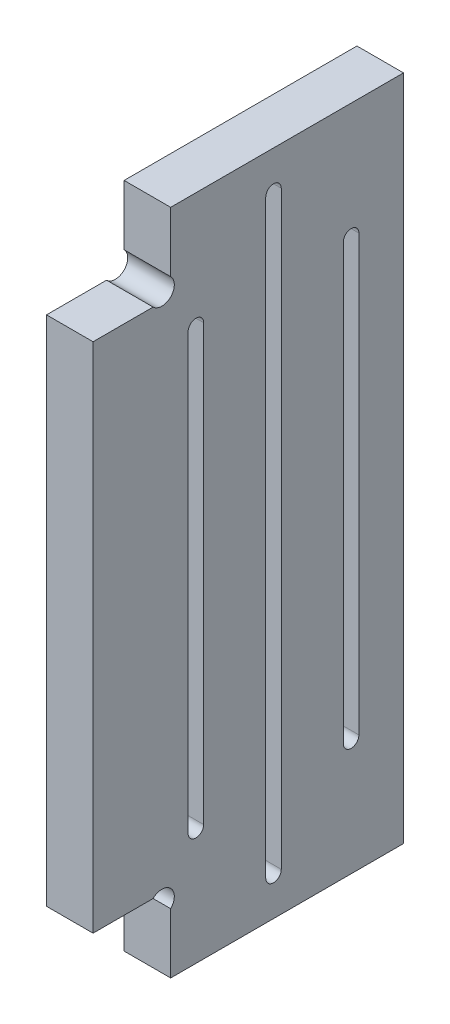
ISO-10303-21;
HEADER;
FILE_DESCRIPTION(('STEP AP214'),'2;1');
FILE_NAME('part.step','',(''),(''),'','','');
FILE_SCHEMA(('AUTOMOTIVE_DESIGN { 1 0 10303 214 1 1 1 1 }'));
ENDSEC;
DATA;
#1=APPLICATION_CONTEXT('core data for automotive mechanical design processes');
#2=APPLICATION_PROTOCOL_DEFINITION('international standard','automotive_design',2000,#1);
#3=PRODUCT_CONTEXT('',#1,'mechanical');
#4=PRODUCT('Part','Part','',(#3));
#5=PRODUCT_RELATED_PRODUCT_CATEGORY('part','',(#4));
#6=PRODUCT_DEFINITION_FORMATION('','',#4);
#7=PRODUCT_DEFINITION_CONTEXT('part definition',#1,'design');
#8=PRODUCT_DEFINITION('design','',#6,#7);
#9=PRODUCT_DEFINITION_SHAPE('','',#8);
#10=(LENGTH_UNIT() NAMED_UNIT(*) SI_UNIT(.MILLI.,.METRE.));
#11=(NAMED_UNIT(*) PLANE_ANGLE_UNIT() SI_UNIT($,.RADIAN.));
#12=(NAMED_UNIT(*) SI_UNIT($,.STERADIAN.) SOLID_ANGLE_UNIT());
#13=UNCERTAINTY_MEASURE_WITH_UNIT(LENGTH_MEASURE(1.E-05),#10,'distance_accuracy_value','');
#14=(GEOMETRIC_REPRESENTATION_CONTEXT(3) GLOBAL_UNCERTAINTY_ASSIGNED_CONTEXT((#13)) GLOBAL_UNIT_ASSIGNED_CONTEXT((#10,
#11,#12)) REPRESENTATION_CONTEXT('',''));
#15=CARTESIAN_POINT('',(0.,0.,0.));
#16=DIRECTION('',(0.,0.,1.));
#17=DIRECTION('',(1.,0.,0.));
#18=AXIS2_PLACEMENT_3D('',#15,#16,#17);
#19=CARTESIAN_POINT('',(6.,219.125569004844,-80.));
#20=DIRECTION('',(0.,0.,-1.));
#21=DIRECTION('',(-1.,0.,0.));
#22=AXIS2_PLACEMENT_3D('',#19,#20,#21);
#23=PLANE('',#22);
#24=DIRECTION('',(0.,-1.,0.));
#25=VECTOR('',#24,1.);
#26=CARTESIAN_POINT('',(0.,219.125569004844,-80.));
#27=LINE('',#26,#25);
#28=CARTESIAN_POINT('',(0.,226.862827305047,-80.));
#29=VERTEX_POINT('',#28);
#30=CARTESIAN_POINT('',(0.,219.125569004844,-80.));
#31=VERTEX_POINT('',#30);
#32=EDGE_CURVE('E219',#29,#31,#27,.T.);
#33=ORIENTED_EDGE('',*,*,#32,.T.);
#34=DIRECTION('',(-1.,0.,0.));
#35=VECTOR('',#34,1.);
#36=CARTESIAN_POINT('',(6.,219.125569004844,-80.));
#37=LINE('',#36,#35);
#38=CARTESIAN_POINT('',(6.,219.125569004844,-80.));
#39=VERTEX_POINT('',#38);
#40=EDGE_CURVE('E11',#39,#31,#37,.T.);
#41=ORIENTED_EDGE('',*,*,#40,.F.);
#42=DIRECTION('',(0.,-1.,0.));
#43=VECTOR('',#42,1.);
#44=CARTESIAN_POINT('',(6.,219.125569004844,-80.));
#45=LINE('',#44,#43);
#46=CARTESIAN_POINT('',(6.,226.862827305047,-80.));
#47=VERTEX_POINT('',#46);
#48=EDGE_CURVE('E284',#47,#39,#45,.T.);
#49=ORIENTED_EDGE('',*,*,#48,.F.);
#50=DIRECTION('',(-1.,0.,0.));
#51=VECTOR('',#50,1.);
#52=CARTESIAN_POINT('',(6.,226.862827305047,-80.));
#53=LINE('',#52,#51);
#54=EDGE_CURVE('E306',#47,#29,#53,.T.);
#55=ORIENTED_EDGE('',*,*,#54,.T.);
#56=EDGE_LOOP('',(#33,#41,#49,#55));
#57=FACE_BOUND('',#56,.T.);
#58=ADVANCED_FACE('F33',(#57),#23,.F.);
#59=CARTESIAN_POINT('',(6.,217.994198154946,-78.8686291501015));
#60=DIRECTION('',(-1.,0.,0.));
#61=DIRECTION('',(0.,0.,1.));
#62=AXIS2_PLACEMENT_3D('',#59,#60,#61);
#63=CYLINDRICAL_SURFACE('',#62,1.6);
#64=CARTESIAN_POINT('',(0.,217.994198154946,-78.8686291501015));
#65=DIRECTION('',(-1.,0.,0.));
#66=DIRECTION('',(0.,0.,1.));
#67=AXIS2_PLACEMENT_3D('',#64,#65,#66);
#68=CIRCLE('',#67,1.6);
#69=CARTESIAN_POINT('',(0.,216.862827305047,-77.737258300203));
#70=VERTEX_POINT('',#69);
#71=EDGE_CURVE('E309',#31,#70,#68,.T.);
#72=ORIENTED_EDGE('',*,*,#71,.T.);
#73=DIRECTION('',(-1.,0.,0.));
#74=VECTOR('',#73,1.);
#75=CARTESIAN_POINT('',(6.,216.862827305047,-77.737258300203));
#76=LINE('',#75,#74);
#77=CARTESIAN_POINT('',(6.,216.862827305047,-77.737258300203));
#78=VERTEX_POINT('',#77);
#79=EDGE_CURVE('E40',#78,#70,#76,.T.);
#80=ORIENTED_EDGE('',*,*,#79,.F.);
#81=CARTESIAN_POINT('',(6.,217.994198154946,-78.8686291501015));
#82=DIRECTION('',(-1.,0.,0.));
#83=DIRECTION('',(0.,0.,1.));
#84=AXIS2_PLACEMENT_3D('',#81,#82,#83);
#85=CIRCLE('',#84,1.6);
#86=EDGE_CURVE('E287',#39,#78,#85,.T.);
#87=ORIENTED_EDGE('',*,*,#86,.F.);
#88=ORIENTED_EDGE('',*,*,#40,.T.);
#89=EDGE_LOOP('',(#72,#80,#87,#88));
#90=FACE_BOUND('',#89,.T.);
#91=ADVANCED_FACE('F375',(#90),#63,.F.);
#92=CARTESIAN_POINT('',(6.,216.862827305047,-77.737258300203));
#93=DIRECTION('',(0.,-1.,0.));
#94=DIRECTION('',(0.,0.,-1.));
#95=AXIS2_PLACEMENT_3D('',#92,#93,#94);
#96=PLANE('',#95);
#97=DIRECTION('',(0.,0.,1.));
#98=VECTOR('',#97,1.);
#99=CARTESIAN_POINT('',(0.,216.862827305047,-77.737258300203));
#100=LINE('',#99,#98);
#101=CARTESIAN_POINT('',(0.,216.862827305047,-70.));
#102=VERTEX_POINT('',#101);
#103=EDGE_CURVE('E311',#70,#102,#100,.T.);
#104=ORIENTED_EDGE('',*,*,#103,.T.);
#105=DIRECTION('',(-1.,0.,0.));
#106=VECTOR('',#105,1.);
#107=CARTESIAN_POINT('',(6.,216.862827305047,-70.));
#108=LINE('',#107,#106);
#109=CARTESIAN_POINT('',(6.,216.862827305047,-70.));
#110=VERTEX_POINT('',#109);
#111=EDGE_CURVE('E346',#110,#102,#108,.T.);
#112=ORIENTED_EDGE('',*,*,#111,.F.);
#113=DIRECTION('',(0.,0.,1.));
#114=VECTOR('',#113,1.);
#115=CARTESIAN_POINT('',(6.,216.862827305047,-77.737258300203));
#116=LINE('',#115,#114);
#117=EDGE_CURVE('E290',#78,#110,#116,.T.);
#118=ORIENTED_EDGE('',*,*,#117,.F.);
#119=ORIENTED_EDGE('',*,*,#79,.T.);
#120=EDGE_LOOP('',(#104,#112,#118,#119));
#121=FACE_BOUND('',#120,.T.);
#122=ADVANCED_FACE('F353',(#121),#96,.F.);
#123=CARTESIAN_POINT('',(6.,150.862827305047,-70.));
#124=DIRECTION('',(0.,0.,-1.));
#125=DIRECTION('',(-1.,0.,0.));
#126=AXIS2_PLACEMENT_3D('',#123,#124,#125);
#127=PLANE('',#126);
#128=DIRECTION('',(0.,-1.,0.));
#129=VECTOR('',#128,1.);
#130=CARTESIAN_POINT('',(0.,150.862827305047,-70.));
#131=LINE('',#130,#129);
#132=CARTESIAN_POINT('',(0.,150.862827305047,-70.));
#133=VERTEX_POINT('',#132);
#134=EDGE_CURVE('E313',#102,#133,#131,.T.);
#135=ORIENTED_EDGE('',*,*,#134,.T.);
#136=DIRECTION('',(-1.,0.,0.));
#137=VECTOR('',#136,1.);
#138=CARTESIAN_POINT('',(6.,150.862827305047,-70.));
#139=LINE('',#138,#137);
#140=CARTESIAN_POINT('',(6.,150.862827305047,-70.));
#141=VERTEX_POINT('',#140);
#142=EDGE_CURVE('E343',#141,#133,#139,.T.);
#143=ORIENTED_EDGE('',*,*,#142,.F.);
#144=DIRECTION('',(0.,-1.,0.));
#145=VECTOR('',#144,1.);
#146=CARTESIAN_POINT('',(6.,150.862827305047,-70.));
#147=LINE('',#146,#145);
#148=EDGE_CURVE('E292',#110,#141,#147,.T.);
#149=ORIENTED_EDGE('',*,*,#148,.F.);
#150=ORIENTED_EDGE('',*,*,#111,.T.);
#151=EDGE_LOOP('',(#135,#143,#149,#150));
#152=FACE_BOUND('',#151,.T.);
#153=ADVANCED_FACE('F364',(#152),#127,.F.);
#154=CARTESIAN_POINT('',(6.,150.862827305047,-77.737258300203));
#155=DIRECTION('',(0.,1.,0.));
#156=DIRECTION('',(0.,0.,1.));
#157=AXIS2_PLACEMENT_3D('',#154,#155,#156);
#158=PLANE('',#157);
#159=DIRECTION('',(0.,0.,-1.));
#160=VECTOR('',#159,1.);
#161=CARTESIAN_POINT('',(0.,150.862827305047,-77.737258300203));
#162=LINE('',#161,#160);
#163=CARTESIAN_POINT('',(0.,150.862827305047,-77.737258300203));
#164=VERTEX_POINT('',#163);
#165=EDGE_CURVE('E315',#133,#164,#162,.T.);
#166=ORIENTED_EDGE('',*,*,#165,.T.);
#167=DIRECTION('',(-1.,0.,0.));
#168=VECTOR('',#167,1.);
#169=CARTESIAN_POINT('',(6.,150.862827305047,-77.737258300203));
#170=LINE('',#169,#168);
#171=CARTESIAN_POINT('',(6.,150.862827305047,-77.737258300203));
#172=VERTEX_POINT('',#171);
#173=EDGE_CURVE('E340',#172,#164,#170,.T.);
#174=ORIENTED_EDGE('',*,*,#173,.F.);
#175=DIRECTION('',(0.,0.,-1.));
#176=VECTOR('',#175,1.);
#177=CARTESIAN_POINT('',(6.,150.862827305047,-77.737258300203));
#178=LINE('',#177,#176);
#179=EDGE_CURVE('E294',#141,#172,#178,.T.);
#180=ORIENTED_EDGE('',*,*,#179,.F.);
#181=ORIENTED_EDGE('',*,*,#142,.T.);
#182=EDGE_LOOP('',(#166,#174,#180,#181));
#183=FACE_BOUND('',#182,.T.);
#184=ADVANCED_FACE('F368',(#183),#158,.F.);
#185=CARTESIAN_POINT('',(6.,149.731456455149,-78.8686291501015));
#186=DIRECTION('',(-1.,0.,0.));
#187=DIRECTION('',(0.,0.,1.));
#188=AXIS2_PLACEMENT_3D('',#185,#186,#187);
#189=CYLINDRICAL_SURFACE('',#188,1.6);
#190=CARTESIAN_POINT('',(0.,149.731456455149,-78.8686291501015));
#191=DIRECTION('',(-1.,0.,0.));
#192=DIRECTION('',(0.,0.,-1.));
#193=AXIS2_PLACEMENT_3D('',#190,#191,#192);
#194=CIRCLE('',#193,1.6);
#195=CARTESIAN_POINT('',(0.,148.60008560525,-80.));
#196=VERTEX_POINT('',#195);
#197=EDGE_CURVE('E317',#164,#196,#194,.T.);
#198=ORIENTED_EDGE('',*,*,#197,.T.);
#199=DIRECTION('',(-1.,0.,0.));
#200=VECTOR('',#199,1.);
#201=CARTESIAN_POINT('',(6.,148.60008560525,-80.));
#202=LINE('',#201,#200);
#203=CARTESIAN_POINT('',(6.,148.60008560525,-80.));
#204=VERTEX_POINT('',#203);
#205=EDGE_CURVE('E337',#204,#196,#202,.T.);
#206=ORIENTED_EDGE('',*,*,#205,.F.);
#207=CARTESIAN_POINT('',(6.,149.731456455149,-78.8686291501015));
#208=DIRECTION('',(-1.,0.,0.));
#209=DIRECTION('',(0.,0.,-1.));
#210=AXIS2_PLACEMENT_3D('',#207,#208,#209);
#211=CIRCLE('',#210,1.6);
#212=EDGE_CURVE('E296',#172,#204,#211,.T.);
#213=ORIENTED_EDGE('',*,*,#212,.F.);
#214=ORIENTED_EDGE('',*,*,#173,.T.);
#215=EDGE_LOOP('',(#198,#206,#213,#214));
#216=FACE_BOUND('',#215,.T.);
#217=ADVANCED_FACE('F398',(#216),#189,.F.);
#218=CARTESIAN_POINT('',(6.,140.862827305047,-80.));
#219=DIRECTION('',(0.,0.,-1.));
#220=DIRECTION('',(0.,1.,0.));
#221=AXIS2_PLACEMENT_3D('',#218,#219,#220);
#222=PLANE('',#221);
#223=DIRECTION('',(0.,-1.,0.));
#224=VECTOR('',#223,1.);
#225=CARTESIAN_POINT('',(0.,140.862827305047,-80.));
#226=LINE('',#225,#224);
#227=CARTESIAN_POINT('',(0.,140.862827305047,-80.));
#228=VERTEX_POINT('',#227);
#229=EDGE_CURVE('E319',#196,#228,#226,.T.);
#230=ORIENTED_EDGE('',*,*,#229,.T.);
#231=DIRECTION('',(-1.,0.,0.));
#232=VECTOR('',#231,1.);
#233=CARTESIAN_POINT('',(6.,140.862827305047,-80.));
#234=LINE('',#233,#232);
#235=CARTESIAN_POINT('',(6.,140.862827305047,-80.));
#236=VERTEX_POINT('',#235);
#237=EDGE_CURVE('E334',#236,#228,#234,.T.);
#238=ORIENTED_EDGE('',*,*,#237,.F.);
#239=DIRECTION('',(0.,-1.,0.));
#240=VECTOR('',#239,1.);
#241=CARTESIAN_POINT('',(6.,140.862827305047,-80.));
#242=LINE('',#241,#240);
#243=EDGE_CURVE('E298',#204,#236,#242,.T.);
#244=ORIENTED_EDGE('',*,*,#243,.F.);
#245=ORIENTED_EDGE('',*,*,#205,.T.);
#246=EDGE_LOOP('',(#230,#238,#244,#245));
#247=FACE_BOUND('',#246,.T.);
#248=ADVANCED_FACE('F395',(#247),#222,.F.);
#249=CARTESIAN_POINT('',(6.,140.862827305047,-80.));
#250=DIRECTION('',(0.,1.,0.));
#251=DIRECTION('',(0.,0.,1.));
#252=AXIS2_PLACEMENT_3D('',#249,#250,#251);
#253=PLANE('',#252);
#254=DIRECTION('',(0.,0.,-1.));
#255=VECTOR('',#254,1.);
#256=CARTESIAN_POINT('',(0.,140.862827305047,-80.));
#257=LINE('',#256,#255);
#258=CARTESIAN_POINT('',(0.,140.862827305047,-110.));
#259=VERTEX_POINT('',#258);
#260=EDGE_CURVE('E321',#228,#259,#257,.T.);
#261=ORIENTED_EDGE('',*,*,#260,.T.);
#262=DIRECTION('',(-1.,0.,0.));
#263=VECTOR('',#262,1.);
#264=CARTESIAN_POINT('',(6.,140.862827305047,-110.));
#265=LINE('',#264,#263);
#266=CARTESIAN_POINT('',(6.,140.862827305047,-110.));
#267=VERTEX_POINT('',#266);
#268=EDGE_CURVE('E331',#267,#259,#265,.T.);
#269=ORIENTED_EDGE('',*,*,#268,.F.);
#270=DIRECTION('',(0.,0.,-1.));
#271=VECTOR('',#270,1.);
#272=CARTESIAN_POINT('',(6.,140.862827305047,-80.));
#273=LINE('',#272,#271);
#274=EDGE_CURVE('E300',#236,#267,#273,.T.);
#275=ORIENTED_EDGE('',*,*,#274,.F.);
#276=ORIENTED_EDGE('',*,*,#237,.T.);
#277=EDGE_LOOP('',(#261,#269,#275,#276));
#278=FACE_BOUND('',#277,.T.);
#279=ADVANCED_FACE('F391',(#278),#253,.F.);
#280=CARTESIAN_POINT('',(6.,140.862827305047,-110.));
#281=DIRECTION('',(0.,0.,1.));
#282=DIRECTION('',(1.,0.,0.));
#283=AXIS2_PLACEMENT_3D('',#280,#281,#282);
#284=PLANE('',#283);
#285=DIRECTION('',(0.,1.,0.));
#286=VECTOR('',#285,1.);
#287=CARTESIAN_POINT('',(0.,140.862827305047,-110.));
#288=LINE('',#287,#286);
#289=CARTESIAN_POINT('',(0.,226.862827305047,-110.));
#290=VERTEX_POINT('',#289);
#291=EDGE_CURVE('E323',#259,#290,#288,.T.);
#292=ORIENTED_EDGE('',*,*,#291,.T.);
#293=DIRECTION('',(-1.,0.,0.));
#294=VECTOR('',#293,1.);
#295=CARTESIAN_POINT('',(6.,226.862827305047,-110.));
#296=LINE('',#295,#294);
#297=CARTESIAN_POINT('',(6.,226.862827305047,-110.));
#298=VERTEX_POINT('',#297);
#299=EDGE_CURVE('E328',#298,#290,#296,.T.);
#300=ORIENTED_EDGE('',*,*,#299,.F.);
#301=DIRECTION('',(0.,1.,0.));
#302=VECTOR('',#301,1.);
#303=CARTESIAN_POINT('',(6.,140.862827305047,-110.));
#304=LINE('',#303,#302);
#305=EDGE_CURVE('E302',#267,#298,#304,.T.);
#306=ORIENTED_EDGE('',*,*,#305,.F.);
#307=ORIENTED_EDGE('',*,*,#268,.T.);
#308=EDGE_LOOP('',(#292,#300,#306,#307));
#309=FACE_BOUND('',#308,.T.);
#310=ADVANCED_FACE('F387',(#309),#284,.F.);
#311=CARTESIAN_POINT('',(6.,226.862827305047,-110.));
#312=DIRECTION('',(0.,-1.,0.));
#313=DIRECTION('',(0.,0.,-1.));
#314=AXIS2_PLACEMENT_3D('',#311,#312,#313);
#315=PLANE('',#314);
#316=DIRECTION('',(0.,0.,1.));
#317=VECTOR('',#316,1.);
#318=CARTESIAN_POINT('',(0.,226.862827305047,-110.));
#319=LINE('',#318,#317);
#320=EDGE_CURVE('E288',#290,#29,#319,.T.);
#321=ORIENTED_EDGE('',*,*,#320,.T.);
#322=ORIENTED_EDGE('',*,*,#54,.F.);
#323=DIRECTION('',(0.,0.,1.));
#324=VECTOR('',#323,1.);
#325=CARTESIAN_POINT('',(6.,226.862827305047,-110.));
#326=LINE('',#325,#324);
#327=EDGE_CURVE('E304',#298,#47,#326,.T.);
#328=ORIENTED_EDGE('',*,*,#327,.F.);
#329=ORIENTED_EDGE('',*,*,#299,.T.);
#330=EDGE_LOOP('',(#321,#322,#328,#329));
#331=FACE_BOUND('',#330,.T.);
#332=ADVANCED_FACE('F382',(#331),#315,.F.);
#333=CARTESIAN_POINT('',(6.,149.731456455149,-78.8686291501015));
#334=DIRECTION('',(1.,0.,0.));
#335=DIRECTION('',(0.,0.,-1.));
#336=AXIS2_PLACEMENT_3D('',#333,#334,#335);
#337=PLANE('',#336);
#338=CARTESIAN_POINT('',(6.,155.862827305047,-83.25));
#339=DIRECTION('',(-1.,0.,0.));
#340=DIRECTION('',(0.,0.,1.));
#341=AXIS2_PLACEMENT_3D('',#338,#339,#340);
#342=CIRCLE('',#341,1.);
#343=CARTESIAN_POINT('',(6.,155.862827305047,-84.25));
#344=VERTEX_POINT('',#343);
#345=CARTESIAN_POINT('',(6.,155.862827305047,-82.25));
#346=VERTEX_POINT('',#345);
#347=EDGE_CURVE('E185',#344,#346,#342,.T.);
#348=ORIENTED_EDGE('',*,*,#347,.T.);
#349=DIRECTION('',(0.,1.,0.));
#350=VECTOR('',#349,1.);
#351=CARTESIAN_POINT('',(6.,155.862827305047,-82.25));
#352=LINE('',#351,#350);
#353=CARTESIAN_POINT('',(6.,211.862827305047,-82.25));
#354=VERTEX_POINT('',#353);
#355=EDGE_CURVE('E196',#346,#354,#352,.T.);
#356=ORIENTED_EDGE('',*,*,#355,.T.);
#357=CARTESIAN_POINT('',(6.,211.862827305047,-83.25));
#358=DIRECTION('',(-1.,0.,0.));
#359=DIRECTION('',(0.,0.,1.));
#360=AXIS2_PLACEMENT_3D('',#357,#358,#359);
#361=CIRCLE('',#360,0.999999999999987);
#362=CARTESIAN_POINT('',(6.,211.862827305047,-84.25));
#363=VERTEX_POINT('',#362);
#364=EDGE_CURVE('E47',#354,#363,#361,.T.);
#365=ORIENTED_EDGE('',*,*,#364,.T.);
#366=DIRECTION('',(0.,-1.,0.));
#367=VECTOR('',#366,1.);
#368=CARTESIAN_POINT('',(6.,155.862827305047,-84.25));
#369=LINE('',#368,#367);
#370=EDGE_CURVE('E193',#363,#344,#369,.T.);
#371=ORIENTED_EDGE('',*,*,#370,.T.);
#372=EDGE_LOOP('',(#348,#356,#365,#371));
#373=FACE_BOUND('',#372,.T.);
#374=CARTESIAN_POINT('',(6.,145.862827305047,-93.25));
#375=DIRECTION('',(-1.,0.,0.));
#376=DIRECTION('',(0.,0.,1.));
#377=AXIS2_PLACEMENT_3D('',#374,#375,#376);
#378=CIRCLE('',#377,1.);
#379=CARTESIAN_POINT('',(6.,145.862827305047,-94.25));
#380=VERTEX_POINT('',#379);
#381=CARTESIAN_POINT('',(6.,145.862827305047,-92.25));
#382=VERTEX_POINT('',#381);
#383=EDGE_CURVE('E223',#380,#382,#378,.T.);
#384=ORIENTED_EDGE('',*,*,#383,.T.);
#385=DIRECTION('',(0.,1.,0.));
#386=VECTOR('',#385,1.);
#387=CARTESIAN_POINT('',(6.,145.862827305047,-92.25));
#388=LINE('',#387,#386);
#389=CARTESIAN_POINT('',(6.,221.862827305047,-92.25));
#390=VERTEX_POINT('',#389);
#391=EDGE_CURVE('E226',#382,#390,#388,.T.);
#392=ORIENTED_EDGE('',*,*,#391,.T.);
#393=CARTESIAN_POINT('',(6.,221.862827305047,-93.25));
#394=DIRECTION('',(-1.,0.,0.));
#395=DIRECTION('',(0.,0.,1.));
#396=AXIS2_PLACEMENT_3D('',#393,#394,#395);
#397=CIRCLE('',#396,1.);
#398=CARTESIAN_POINT('',(6.,221.862827305047,-94.25));
#399=VERTEX_POINT('',#398);
#400=EDGE_CURVE('E55',#390,#399,#397,.T.);
#401=ORIENTED_EDGE('',*,*,#400,.T.);
#402=DIRECTION('',(0.,-1.,0.));
#403=VECTOR('',#402,1.);
#404=CARTESIAN_POINT('',(6.,145.862827305047,-94.25));
#405=LINE('',#404,#403);
#406=EDGE_CURVE('E231',#399,#380,#405,.T.);
#407=ORIENTED_EDGE('',*,*,#406,.T.);
#408=EDGE_LOOP('',(#384,#392,#401,#407));
#409=FACE_BOUND('',#408,.T.);
#410=CARTESIAN_POINT('',(6.,155.862827305047,-103.25));
#411=DIRECTION('',(-1.,0.,0.));
#412=DIRECTION('',(0.,0.,1.));
#413=AXIS2_PLACEMENT_3D('',#410,#411,#412);
#414=CIRCLE('',#413,1.);
#415=CARTESIAN_POINT('',(6.,155.862827305047,-104.25));
#416=VERTEX_POINT('',#415);
#417=CARTESIAN_POINT('',(6.,155.862827305047,-102.25));
#418=VERTEX_POINT('',#417);
#419=EDGE_CURVE('E253',#416,#418,#414,.T.);
#420=ORIENTED_EDGE('',*,*,#419,.T.);
#421=DIRECTION('',(0.,1.,0.));
#422=VECTOR('',#421,1.);
#423=CARTESIAN_POINT('',(6.,155.862827305047,-102.25));
#424=LINE('',#423,#422);
#425=CARTESIAN_POINT('',(6.,211.862827305047,-102.25));
#426=VERTEX_POINT('',#425);
#427=EDGE_CURVE('E256',#418,#426,#424,.T.);
#428=ORIENTED_EDGE('',*,*,#427,.T.);
#429=CARTESIAN_POINT('',(6.,211.862827305047,-103.25));
#430=DIRECTION('',(-1.,0.,0.));
#431=DIRECTION('',(0.,0.,1.));
#432=AXIS2_PLACEMENT_3D('',#429,#430,#431);
#433=CIRCLE('',#432,1.);
#434=CARTESIAN_POINT('',(6.,211.862827305047,-104.25));
#435=VERTEX_POINT('',#434);
#436=EDGE_CURVE('E260',#426,#435,#433,.T.);
#437=ORIENTED_EDGE('',*,*,#436,.T.);
#438=DIRECTION('',(0.,-1.,0.));
#439=VECTOR('',#438,1.);
#440=CARTESIAN_POINT('',(6.,155.862827305047,-104.25));
#441=LINE('',#440,#439);
#442=EDGE_CURVE('E263',#435,#416,#441,.T.);
#443=ORIENTED_EDGE('',*,*,#442,.T.);
#444=EDGE_LOOP('',(#420,#428,#437,#443));
#445=FACE_BOUND('',#444,.T.);
#446=ORIENTED_EDGE('',*,*,#48,.T.);
#447=ORIENTED_EDGE('',*,*,#86,.T.);
#448=ORIENTED_EDGE('',*,*,#117,.T.);
#449=ORIENTED_EDGE('',*,*,#148,.T.);
#450=ORIENTED_EDGE('',*,*,#179,.T.);
#451=ORIENTED_EDGE('',*,*,#212,.T.);
#452=ORIENTED_EDGE('',*,*,#243,.T.);
#453=ORIENTED_EDGE('',*,*,#274,.T.);
#454=ORIENTED_EDGE('',*,*,#305,.T.);
#455=ORIENTED_EDGE('',*,*,#327,.T.);
#456=EDGE_LOOP('',(#446,#447,#448,#449,#450,#451,#452,#453,#454,#455));
#457=FACE_BOUND('',#456,.T.);
#458=ADVANCED_FACE('F200',(#373,#409,#445,#457),#337,.T.);
#459=CARTESIAN_POINT('',(0.,149.731456455149,-78.8686291501015));
#460=DIRECTION('',(1.,0.,0.));
#461=DIRECTION('',(0.,0.,-1.));
#462=AXIS2_PLACEMENT_3D('',#459,#460,#461);
#463=PLANE('',#462);
#464=DIRECTION('',(0.,1.,0.));
#465=VECTOR('',#464,1.);
#466=CARTESIAN_POINT('',(0.,155.862827305047,-82.25));
#467=LINE('',#466,#465);
#468=CARTESIAN_POINT('',(0.,155.862827305047,-82.25));
#469=VERTEX_POINT('',#468);
#470=CARTESIAN_POINT('',(0.,211.862827305047,-82.25));
#471=VERTEX_POINT('',#470);
#472=EDGE_CURVE('E212',#469,#471,#467,.T.);
#473=ORIENTED_EDGE('',*,*,#472,.F.);
#474=CARTESIAN_POINT('',(0.,155.862827305047,-83.25));
#475=DIRECTION('',(-1.,0.,0.));
#476=DIRECTION('',(0.,0.,1.));
#477=AXIS2_PLACEMENT_3D('',#474,#475,#476);
#478=CIRCLE('',#477,1.);
#479=CARTESIAN_POINT('',(0.,155.862827305047,-84.25));
#480=VERTEX_POINT('',#479);
#481=EDGE_CURVE('E188',#480,#469,#478,.T.);
#482=ORIENTED_EDGE('',*,*,#481,.F.);
#483=DIRECTION('',(0.,-1.,0.));
#484=VECTOR('',#483,1.);
#485=CARTESIAN_POINT('',(0.,155.862827305047,-84.25));
#486=LINE('',#485,#484);
#487=CARTESIAN_POINT('',(0.,211.862827305047,-84.25));
#488=VERTEX_POINT('',#487);
#489=EDGE_CURVE('E203',#488,#480,#486,.T.);
#490=ORIENTED_EDGE('',*,*,#489,.F.);
#491=CARTESIAN_POINT('',(0.,211.862827305047,-83.25));
#492=DIRECTION('',(-1.,0.,0.));
#493=DIRECTION('',(0.,0.,1.));
#494=AXIS2_PLACEMENT_3D('',#491,#492,#493);
#495=CIRCLE('',#494,0.999999999999987);
#496=EDGE_CURVE('E206',#471,#488,#495,.T.);
#497=ORIENTED_EDGE('',*,*,#496,.F.);
#498=EDGE_LOOP('',(#473,#482,#490,#497));
#499=FACE_BOUND('',#498,.T.);
#500=DIRECTION('',(0.,1.,0.));
#501=VECTOR('',#500,1.);
#502=CARTESIAN_POINT('',(0.,145.862827305047,-92.25));
#503=LINE('',#502,#501);
#504=CARTESIAN_POINT('',(0.,145.862827305047,-92.25));
#505=VERTEX_POINT('',#504);
#506=CARTESIAN_POINT('',(0.,221.862827305047,-92.25));
#507=VERTEX_POINT('',#506);
#508=EDGE_CURVE('E237',#505,#507,#503,.T.);
#509=ORIENTED_EDGE('',*,*,#508,.F.);
#510=CARTESIAN_POINT('',(0.,145.862827305047,-93.25));
#511=DIRECTION('',(-1.,0.,0.));
#512=DIRECTION('',(0.,0.,1.));
#513=AXIS2_PLACEMENT_3D('',#510,#511,#512);
#514=CIRCLE('',#513,1.);
#515=CARTESIAN_POINT('',(0.,145.862827305047,-94.25));
#516=VERTEX_POINT('',#515);
#517=EDGE_CURVE('E235',#516,#505,#514,.T.);
#518=ORIENTED_EDGE('',*,*,#517,.F.);
#519=DIRECTION('',(0.,-1.,0.));
#520=VECTOR('',#519,1.);
#521=CARTESIAN_POINT('',(0.,145.862827305047,-94.25));
#522=LINE('',#521,#520);
#523=CARTESIAN_POINT('',(0.,221.862827305047,-94.25));
#524=VERTEX_POINT('',#523);
#525=EDGE_CURVE('E227',#524,#516,#522,.T.);
#526=ORIENTED_EDGE('',*,*,#525,.F.);
#527=CARTESIAN_POINT('',(0.,221.862827305047,-93.25));
#528=DIRECTION('',(-1.,0.,0.));
#529=DIRECTION('',(0.,0.,1.));
#530=AXIS2_PLACEMENT_3D('',#527,#528,#529);
#531=CIRCLE('',#530,1.);
#532=EDGE_CURVE('E241',#507,#524,#531,.T.);
#533=ORIENTED_EDGE('',*,*,#532,.F.);
#534=EDGE_LOOP('',(#509,#518,#526,#533));
#535=FACE_BOUND('',#534,.T.);
#536=DIRECTION('',(0.,1.,0.));
#537=VECTOR('',#536,1.);
#538=CARTESIAN_POINT('',(0.,155.862827305047,-102.25));
#539=LINE('',#538,#537);
#540=CARTESIAN_POINT('',(0.,155.862827305047,-102.25));
#541=VERTEX_POINT('',#540);
#542=CARTESIAN_POINT('',(0.,211.862827305047,-102.25));
#543=VERTEX_POINT('',#542);
#544=EDGE_CURVE('E269',#541,#543,#539,.T.);
#545=ORIENTED_EDGE('',*,*,#544,.F.);
#546=CARTESIAN_POINT('',(0.,155.862827305047,-103.25));
#547=DIRECTION('',(-1.,0.,0.));
#548=DIRECTION('',(0.,0.,1.));
#549=AXIS2_PLACEMENT_3D('',#546,#547,#548);
#550=CIRCLE('',#549,1.);
#551=CARTESIAN_POINT('',(0.,155.862827305047,-104.25));
#552=VERTEX_POINT('',#551);
#553=EDGE_CURVE('E267',#552,#541,#550,.T.);
#554=ORIENTED_EDGE('',*,*,#553,.F.);
#555=DIRECTION('',(0.,-1.,0.));
#556=VECTOR('',#555,1.);
#557=CARTESIAN_POINT('',(0.,155.862827305047,-104.25));
#558=LINE('',#557,#556);
#559=CARTESIAN_POINT('',(0.,211.862827305047,-104.25));
#560=VERTEX_POINT('',#559);
#561=EDGE_CURVE('E257',#560,#552,#558,.T.);
#562=ORIENTED_EDGE('',*,*,#561,.F.);
#563=CARTESIAN_POINT('',(0.,211.862827305047,-103.25));
#564=DIRECTION('',(-1.,0.,0.));
#565=DIRECTION('',(0.,0.,1.));
#566=AXIS2_PLACEMENT_3D('',#563,#564,#565);
#567=CIRCLE('',#566,1.);
#568=EDGE_CURVE('E272',#543,#560,#567,.T.);
#569=ORIENTED_EDGE('',*,*,#568,.F.);
#570=EDGE_LOOP('',(#545,#554,#562,#569));
#571=FACE_BOUND('',#570,.T.);
#572=ORIENTED_EDGE('',*,*,#32,.F.);
#573=ORIENTED_EDGE('',*,*,#320,.F.);
#574=ORIENTED_EDGE('',*,*,#291,.F.);
#575=ORIENTED_EDGE('',*,*,#260,.F.);
#576=ORIENTED_EDGE('',*,*,#229,.F.);
#577=ORIENTED_EDGE('',*,*,#197,.F.);
#578=ORIENTED_EDGE('',*,*,#165,.F.);
#579=ORIENTED_EDGE('',*,*,#134,.F.);
#580=ORIENTED_EDGE('',*,*,#103,.F.);
#581=ORIENTED_EDGE('',*,*,#71,.F.);
#582=EDGE_LOOP('',(#572,#573,#574,#575,#576,#577,#578,#579,#580,#581));
#583=FACE_BOUND('',#582,.T.);
#584=ADVANCED_FACE('F359',(#499,#535,#571,#583),#463,.F.);
#585=CARTESIAN_POINT('',(6.,155.862827305047,-103.25));
#586=DIRECTION('',(-1.,0.,0.));
#587=DIRECTION('',(0.,0.,1.));
#588=AXIS2_PLACEMENT_3D('',#585,#586,#587);
#589=CYLINDRICAL_SURFACE('',#588,1.);
#590=ORIENTED_EDGE('',*,*,#553,.T.);
#591=DIRECTION('',(-1.,0.,0.));
#592=VECTOR('',#591,1.);
#593=CARTESIAN_POINT('',(6.,155.862827305047,-102.25));
#594=LINE('',#593,#592);
#595=EDGE_CURVE('E266',#418,#541,#594,.T.);
#596=ORIENTED_EDGE('',*,*,#595,.F.);
#597=ORIENTED_EDGE('',*,*,#419,.F.);
#598=DIRECTION('',(-1.,0.,0.));
#599=VECTOR('',#598,1.);
#600=CARTESIAN_POINT('',(6.,155.862827305047,-104.25));
#601=LINE('',#600,#599);
#602=EDGE_CURVE('E238',#416,#552,#601,.T.);
#603=ORIENTED_EDGE('',*,*,#602,.T.);
#604=EDGE_LOOP('',(#590,#596,#597,#603));
#605=FACE_BOUND('',#604,.T.);
#606=ADVANCED_FACE('F476',(#605),#589,.F.);
#607=CARTESIAN_POINT('',(6.,155.862827305047,-104.25));
#608=DIRECTION('',(0.,0.,-1.));
#609=DIRECTION('',(-1.,0.,0.));
#610=AXIS2_PLACEMENT_3D('',#607,#608,#609);
#611=PLANE('',#610);
#612=ORIENTED_EDGE('',*,*,#561,.T.);
#613=ORIENTED_EDGE('',*,*,#602,.F.);
#614=ORIENTED_EDGE('',*,*,#442,.F.);
#615=DIRECTION('',(-1.,0.,0.));
#616=VECTOR('',#615,1.);
#617=CARTESIAN_POINT('',(6.,211.862827305047,-104.25));
#618=LINE('',#617,#616);
#619=EDGE_CURVE('E278',#435,#560,#618,.T.);
#620=ORIENTED_EDGE('',*,*,#619,.T.);
#621=EDGE_LOOP('',(#612,#613,#614,#620));
#622=FACE_BOUND('',#621,.T.);
#623=ADVANCED_FACE('F486',(#622),#611,.F.);
#624=CARTESIAN_POINT('',(6.,211.862827305047,-103.25));
#625=DIRECTION('',(-1.,0.,0.));
#626=DIRECTION('',(0.,0.,1.));
#627=AXIS2_PLACEMENT_3D('',#624,#625,#626);
#628=CYLINDRICAL_SURFACE('',#627,1.);
#629=ORIENTED_EDGE('',*,*,#568,.T.);
#630=ORIENTED_EDGE('',*,*,#619,.F.);
#631=ORIENTED_EDGE('',*,*,#436,.F.);
#632=DIRECTION('',(-1.,0.,0.));
#633=VECTOR('',#632,1.);
#634=CARTESIAN_POINT('',(6.,211.862827305047,-102.25));
#635=LINE('',#634,#633);
#636=EDGE_CURVE('E280',#426,#543,#635,.T.);
#637=ORIENTED_EDGE('',*,*,#636,.T.);
#638=EDGE_LOOP('',(#629,#630,#631,#637));
#639=FACE_BOUND('',#638,.T.);
#640=ADVANCED_FACE('F496',(#639),#628,.F.);
#641=CARTESIAN_POINT('',(6.,155.862827305047,-102.25));
#642=DIRECTION('',(0.,0.,1.));
#643=DIRECTION('',(1.,0.,0.));
#644=AXIS2_PLACEMENT_3D('',#641,#642,#643);
#645=PLANE('',#644);
#646=ORIENTED_EDGE('',*,*,#544,.T.);
#647=ORIENTED_EDGE('',*,*,#636,.F.);
#648=ORIENTED_EDGE('',*,*,#427,.F.);
#649=ORIENTED_EDGE('',*,*,#595,.T.);
#650=EDGE_LOOP('',(#646,#647,#648,#649));
#651=FACE_BOUND('',#650,.T.);
#652=ADVANCED_FACE('F506',(#651),#645,.F.);
#653=CARTESIAN_POINT('',(6.,145.862827305047,-93.25));
#654=DIRECTION('',(-1.,0.,0.));
#655=DIRECTION('',(0.,0.,1.));
#656=AXIS2_PLACEMENT_3D('',#653,#654,#655);
#657=CYLINDRICAL_SURFACE('',#656,1.);
#658=ORIENTED_EDGE('',*,*,#517,.T.);
#659=DIRECTION('',(-1.,0.,0.));
#660=VECTOR('',#659,1.);
#661=CARTESIAN_POINT('',(6.,145.862827305047,-92.25));
#662=LINE('',#661,#660);
#663=EDGE_CURVE('E234',#382,#505,#662,.T.);
#664=ORIENTED_EDGE('',*,*,#663,.F.);
#665=ORIENTED_EDGE('',*,*,#383,.F.);
#666=DIRECTION('',(-1.,0.,0.));
#667=VECTOR('',#666,1.);
#668=CARTESIAN_POINT('',(6.,145.862827305047,-94.25));
#669=LINE('',#668,#667);
#670=EDGE_CURVE('E213',#380,#516,#669,.T.);
#671=ORIENTED_EDGE('',*,*,#670,.T.);
#672=EDGE_LOOP('',(#658,#664,#665,#671));
#673=FACE_BOUND('',#672,.T.);
#674=ADVANCED_FACE('F516',(#673),#657,.F.);
#675=CARTESIAN_POINT('',(6.,145.862827305047,-94.25));
#676=DIRECTION('',(0.,0.,-1.));
#677=DIRECTION('',(-1.,0.,0.));
#678=AXIS2_PLACEMENT_3D('',#675,#676,#677);
#679=PLANE('',#678);
#680=ORIENTED_EDGE('',*,*,#525,.T.);
#681=ORIENTED_EDGE('',*,*,#670,.F.);
#682=ORIENTED_EDGE('',*,*,#406,.F.);
#683=DIRECTION('',(-1.,0.,0.));
#684=VECTOR('',#683,1.);
#685=CARTESIAN_POINT('',(6.,221.862827305047,-94.25));
#686=LINE('',#685,#684);
#687=EDGE_CURVE('E247',#399,#524,#686,.T.);
#688=ORIENTED_EDGE('',*,*,#687,.T.);
#689=EDGE_LOOP('',(#680,#681,#682,#688));
#690=FACE_BOUND('',#689,.T.);
#691=ADVANCED_FACE('F526',(#690),#679,.F.);
#692=CARTESIAN_POINT('',(6.,221.862827305047,-93.25));
#693=DIRECTION('',(-1.,0.,0.));
#694=DIRECTION('',(0.,0.,1.));
#695=AXIS2_PLACEMENT_3D('',#692,#693,#694);
#696=CYLINDRICAL_SURFACE('',#695,1.);
#697=ORIENTED_EDGE('',*,*,#532,.T.);
#698=ORIENTED_EDGE('',*,*,#687,.F.);
#699=ORIENTED_EDGE('',*,*,#400,.F.);
#700=DIRECTION('',(-1.,0.,0.));
#701=VECTOR('',#700,1.);
#702=CARTESIAN_POINT('',(6.,221.862827305047,-92.25));
#703=LINE('',#702,#701);
#704=EDGE_CURVE('E249',#390,#507,#703,.T.);
#705=ORIENTED_EDGE('',*,*,#704,.T.);
#706=EDGE_LOOP('',(#697,#698,#699,#705));
#707=FACE_BOUND('',#706,.T.);
#708=ADVANCED_FACE('F536',(#707),#696,.F.);
#709=CARTESIAN_POINT('',(6.,145.862827305047,-92.25));
#710=DIRECTION('',(0.,0.,1.));
#711=DIRECTION('',(1.,0.,0.));
#712=AXIS2_PLACEMENT_3D('',#709,#710,#711);
#713=PLANE('',#712);
#714=ORIENTED_EDGE('',*,*,#508,.T.);
#715=ORIENTED_EDGE('',*,*,#704,.F.);
#716=ORIENTED_EDGE('',*,*,#391,.F.);
#717=ORIENTED_EDGE('',*,*,#663,.T.);
#718=EDGE_LOOP('',(#714,#715,#716,#717));
#719=FACE_BOUND('',#718,.T.);
#720=ADVANCED_FACE('F546',(#719),#713,.F.);
#721=CARTESIAN_POINT('',(6.,155.862827305047,-83.25));
#722=DIRECTION('',(-1.,0.,0.));
#723=DIRECTION('',(0.,0.,1.));
#724=AXIS2_PLACEMENT_3D('',#721,#722,#723);
#725=CYLINDRICAL_SURFACE('',#724,1.);
#726=ORIENTED_EDGE('',*,*,#481,.T.);
#727=DIRECTION('',(-1.,0.,0.));
#728=VECTOR('',#727,1.);
#729=CARTESIAN_POINT('',(6.,155.862827305047,-82.25));
#730=LINE('',#729,#728);
#731=EDGE_CURVE('E181',#346,#469,#730,.T.);
#732=ORIENTED_EDGE('',*,*,#731,.F.);
#733=ORIENTED_EDGE('',*,*,#347,.F.);
#734=DIRECTION('',(-1.,0.,0.));
#735=VECTOR('',#734,1.);
#736=CARTESIAN_POINT('',(6.,155.862827305047,-84.25));
#737=LINE('',#736,#735);
#738=EDGE_CURVE('E217',#344,#480,#737,.T.);
#739=ORIENTED_EDGE('',*,*,#738,.T.);
#740=EDGE_LOOP('',(#726,#732,#733,#739));
#741=FACE_BOUND('',#740,.T.);
#742=ADVANCED_FACE('F183',(#741),#725,.F.);
#743=CARTESIAN_POINT('',(6.,155.862827305047,-84.25));
#744=DIRECTION('',(0.,0.,-1.));
#745=DIRECTION('',(0.,1.,0.));
#746=AXIS2_PLACEMENT_3D('',#743,#744,#745);
#747=PLANE('',#746);
#748=ORIENTED_EDGE('',*,*,#489,.T.);
#749=ORIENTED_EDGE('',*,*,#738,.F.);
#750=ORIENTED_EDGE('',*,*,#370,.F.);
#751=DIRECTION('',(-1.,0.,0.));
#752=VECTOR('',#751,1.);
#753=CARTESIAN_POINT('',(6.,211.862827305047,-84.25));
#754=LINE('',#753,#752);
#755=EDGE_CURVE('E220',#363,#488,#754,.T.);
#756=ORIENTED_EDGE('',*,*,#755,.T.);
#757=EDGE_LOOP('',(#748,#749,#750,#756));
#758=FACE_BOUND('',#757,.T.);
#759=ADVANCED_FACE('F564',(#758),#747,.F.);
#760=CARTESIAN_POINT('',(6.,211.862827305047,-83.25));
#761=DIRECTION('',(-1.,0.,0.));
#762=DIRECTION('',(0.,0.,1.));
#763=AXIS2_PLACEMENT_3D('',#760,#761,#762);
#764=CYLINDRICAL_SURFACE('',#763,0.999999999999987);
#765=ORIENTED_EDGE('',*,*,#496,.T.);
#766=ORIENTED_EDGE('',*,*,#755,.F.);
#767=ORIENTED_EDGE('',*,*,#364,.F.);
#768=DIRECTION('',(-1.,0.,0.));
#769=VECTOR('',#768,1.);
#770=CARTESIAN_POINT('',(6.,211.862827305047,-82.25));
#771=LINE('',#770,#769);
#772=EDGE_CURVE('E192',#354,#471,#771,.T.);
#773=ORIENTED_EDGE('',*,*,#772,.T.);
#774=EDGE_LOOP('',(#765,#766,#767,#773));
#775=FACE_BOUND('',#774,.T.);
#776=ADVANCED_FACE('F573',(#775),#764,.F.);
#777=CARTESIAN_POINT('',(6.,155.862827305047,-82.25));
#778=DIRECTION('',(0.,0.,1.));
#779=DIRECTION('',(0.,-1.,0.));
#780=AXIS2_PLACEMENT_3D('',#777,#778,#779);
#781=PLANE('',#780);
#782=ORIENTED_EDGE('',*,*,#472,.T.);
#783=ORIENTED_EDGE('',*,*,#772,.F.);
#784=ORIENTED_EDGE('',*,*,#355,.F.);
#785=ORIENTED_EDGE('',*,*,#731,.T.);
#786=EDGE_LOOP('',(#782,#783,#784,#785));
#787=FACE_BOUND('',#786,.T.);
#788=ADVANCED_FACE('F197',(#787),#781,.F.);
#789=CLOSED_SHELL('',(#58,#91,#122,#153,#184,#217,#248,#279,#310,#332,#458,#584,#606,#623,#640,
#652,#674,#691,#708,#720,#742,#759,#776,#788));
#790=MANIFOLD_SOLID_BREP('B2',#789);
#791=ADVANCED_BREP_SHAPE_REPRESENTATION('',(#18,#790),#14);
#792=SHAPE_DEFINITION_REPRESENTATION(#9,#791);
ENDSEC;
END-ISO-10303-21;
